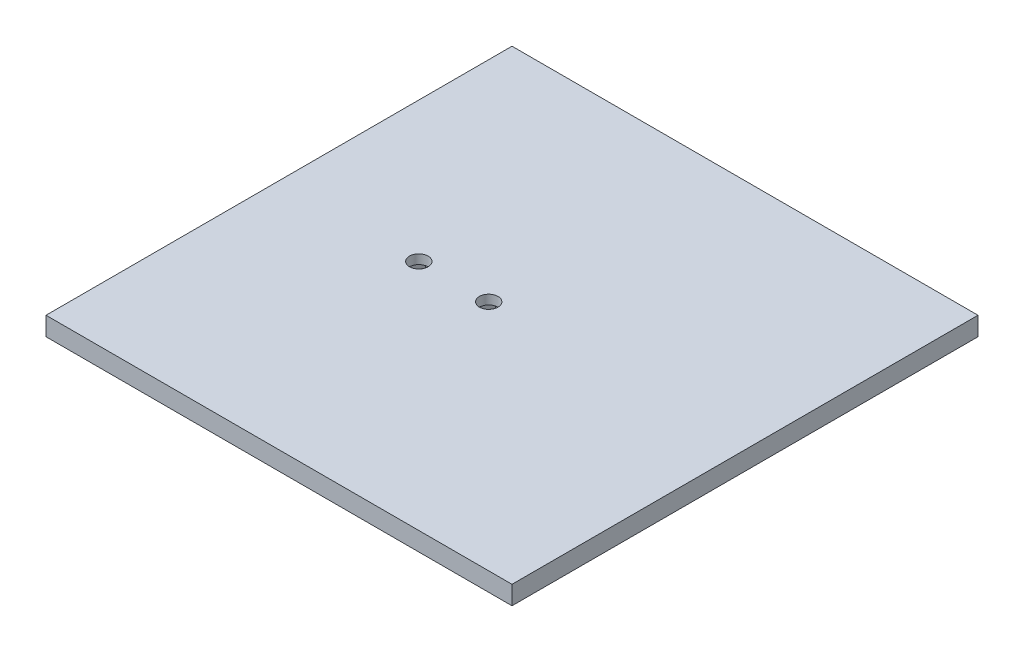
ISO-10303-21;
HEADER;
FILE_DESCRIPTION(('STEP AP214'),'2;1');
FILE_NAME('part.step','',(''),(''),'','','');
FILE_SCHEMA(('AUTOMOTIVE_DESIGN { 1 0 10303 214 1 1 1 1 }'));
ENDSEC;
DATA;
#1=APPLICATION_CONTEXT('core data for automotive mechanical design processes');
#2=APPLICATION_PROTOCOL_DEFINITION('international standard','automotive_design',2000,#1);
#3=PRODUCT_CONTEXT('',#1,'mechanical');
#4=PRODUCT('Part','Part','',(#3));
#5=PRODUCT_RELATED_PRODUCT_CATEGORY('part','',(#4));
#6=PRODUCT_DEFINITION_FORMATION('','',#4);
#7=PRODUCT_DEFINITION_CONTEXT('part definition',#1,'design');
#8=PRODUCT_DEFINITION('design','',#6,#7);
#9=PRODUCT_DEFINITION_SHAPE('','',#8);
#10=(LENGTH_UNIT() NAMED_UNIT(*) SI_UNIT(.MILLI.,.METRE.));
#11=(NAMED_UNIT(*) PLANE_ANGLE_UNIT() SI_UNIT($,.RADIAN.));
#12=(NAMED_UNIT(*) SI_UNIT($,.STERADIAN.) SOLID_ANGLE_UNIT());
#13=UNCERTAINTY_MEASURE_WITH_UNIT(LENGTH_MEASURE(1.E-05),#10,'distance_accuracy_value','');
#14=(GEOMETRIC_REPRESENTATION_CONTEXT(3) GLOBAL_UNCERTAINTY_ASSIGNED_CONTEXT((#13)) GLOBAL_UNIT_ASSIGNED_CONTEXT((#10,
#11,#12)) REPRESENTATION_CONTEXT('',''));
#15=CARTESIAN_POINT('',(0.,0.,0.));
#16=DIRECTION('',(0.,0.,1.));
#17=DIRECTION('',(1.,0.,0.));
#18=AXIS2_PLACEMENT_3D('',#15,#16,#17);
#19=CARTESIAN_POINT('',(-34.8765432098765,4.,-23.5339506172839));
#20=DIRECTION('',(1.,0.,0.));
#21=DIRECTION('',(0.,0.,-1.));
#22=AXIS2_PLACEMENT_3D('',#19,#20,#21);
#23=PLANE('',#22);
#24=DIRECTION('',(0.,0.,1.));
#25=VECTOR('',#24,1.);
#26=CARTESIAN_POINT('',(-34.8765432098765,0.,-23.5339506172839));
#27=LINE('',#26,#25);
#28=CARTESIAN_POINT('',(-34.8765432098765,0.,-23.5339506172839));
#29=VERTEX_POINT('',#28);
#30=CARTESIAN_POINT('',(-34.8765432098765,0.,76.4660493827161));
#31=VERTEX_POINT('',#30);
#32=EDGE_CURVE('E302',#29,#31,#27,.T.);
#33=ORIENTED_EDGE('',*,*,#32,.T.);
#34=DIRECTION('',(0.,-1.,0.));
#35=VECTOR('',#34,1.);
#36=CARTESIAN_POINT('',(-34.8765432098765,4.,76.4660493827161));
#37=LINE('',#36,#35);
#38=CARTESIAN_POINT('',(-34.8765432098765,4.,76.4660493827161));
#39=VERTEX_POINT('',#38);
#40=EDGE_CURVE('E11',#39,#31,#37,.T.);
#41=ORIENTED_EDGE('',*,*,#40,.F.);
#42=DIRECTION('',(0.,0.,1.));
#43=VECTOR('',#42,1.);
#44=CARTESIAN_POINT('',(-34.8765432098765,4.,-23.5339506172839));
#45=LINE('',#44,#43);
#46=CARTESIAN_POINT('',(-34.8765432098765,4.,-23.5339506172839));
#47=VERTEX_POINT('',#46);
#48=EDGE_CURVE('E310',#47,#39,#45,.T.);
#49=ORIENTED_EDGE('',*,*,#48,.F.);
#50=DIRECTION('',(0.,-1.,0.));
#51=VECTOR('',#50,1.);
#52=CARTESIAN_POINT('',(-34.8765432098765,4.,-23.5339506172839));
#53=LINE('',#52,#51);
#54=EDGE_CURVE('E324',#47,#29,#53,.T.);
#55=ORIENTED_EDGE('',*,*,#54,.T.);
#56=EDGE_LOOP('',(#33,#41,#49,#55));
#57=FACE_BOUND('',#56,.T.);
#58=ADVANCED_FACE('F43',(#57),#23,.F.);
#59=CARTESIAN_POINT('',(-34.8765432098765,4.,76.4660493827161));
#60=DIRECTION('',(0.,0.,-1.));
#61=DIRECTION('',(-1.,0.,0.));
#62=AXIS2_PLACEMENT_3D('',#59,#60,#61);
#63=PLANE('',#62);
#64=DIRECTION('',(1.,0.,0.));
#65=VECTOR('',#64,1.);
#66=CARTESIAN_POINT('',(-34.8765432098765,0.,76.4660493827161));
#67=LINE('',#66,#65);
#68=CARTESIAN_POINT('',(65.1234567901235,0.,76.4660493827161));
#69=VERTEX_POINT('',#68);
#70=EDGE_CURVE('E328',#31,#69,#67,.T.);
#71=ORIENTED_EDGE('',*,*,#70,.T.);
#72=DIRECTION('',(0.,-1.,0.));
#73=VECTOR('',#72,1.);
#74=CARTESIAN_POINT('',(65.1234567901235,4.,76.4660493827161));
#75=LINE('',#74,#73);
#76=CARTESIAN_POINT('',(65.1234567901235,4.,76.4660493827161));
#77=VERTEX_POINT('',#76);
#78=EDGE_CURVE('E51',#77,#69,#75,.T.);
#79=ORIENTED_EDGE('',*,*,#78,.F.);
#80=DIRECTION('',(1.,0.,0.));
#81=VECTOR('',#80,1.);
#82=CARTESIAN_POINT('',(-34.8765432098765,4.,76.4660493827161));
#83=LINE('',#82,#81);
#84=EDGE_CURVE('E314',#39,#77,#83,.T.);
#85=ORIENTED_EDGE('',*,*,#84,.F.);
#86=ORIENTED_EDGE('',*,*,#40,.T.);
#87=EDGE_LOOP('',(#71,#79,#85,#86));
#88=FACE_BOUND('',#87,.T.);
#89=ADVANCED_FACE('F364',(#88),#63,.F.);
#90=CARTESIAN_POINT('',(65.1234567901235,4.,-23.5339506172839));
#91=DIRECTION('',(-1.,0.,0.));
#92=DIRECTION('',(0.,0.,1.));
#93=AXIS2_PLACEMENT_3D('',#90,#91,#92);
#94=PLANE('',#93);
#95=DIRECTION('',(0.,0.,-1.));
#96=VECTOR('',#95,1.);
#97=CARTESIAN_POINT('',(65.1234567901235,0.,-23.5339506172839));
#98=LINE('',#97,#96);
#99=CARTESIAN_POINT('',(65.1234567901235,0.,-23.5339506172839));
#100=VERTEX_POINT('',#99);
#101=EDGE_CURVE('E331',#69,#100,#98,.T.);
#102=ORIENTED_EDGE('',*,*,#101,.T.);
#103=DIRECTION('',(0.,-1.,0.));
#104=VECTOR('',#103,1.);
#105=CARTESIAN_POINT('',(65.1234567901235,4.,-23.5339506172839));
#106=LINE('',#105,#104);
#107=CARTESIAN_POINT('',(65.1234567901235,4.,-23.5339506172839));
#108=VERTEX_POINT('',#107);
#109=EDGE_CURVE('E339',#108,#100,#106,.T.);
#110=ORIENTED_EDGE('',*,*,#109,.F.);
#111=DIRECTION('',(0.,0.,-1.));
#112=VECTOR('',#111,1.);
#113=CARTESIAN_POINT('',(65.1234567901235,4.,-23.5339506172839));
#114=LINE('',#113,#112);
#115=EDGE_CURVE('E318',#77,#108,#114,.T.);
#116=ORIENTED_EDGE('',*,*,#115,.F.);
#117=ORIENTED_EDGE('',*,*,#78,.T.);
#118=EDGE_LOOP('',(#102,#110,#116,#117));
#119=FACE_BOUND('',#118,.T.);
#120=ADVANCED_FACE('F348',(#119),#94,.F.);
#121=CARTESIAN_POINT('',(-34.8765432098765,4.,-23.5339506172839));
#122=DIRECTION('',(0.,0.,1.));
#123=DIRECTION('',(1.,0.,0.));
#124=AXIS2_PLACEMENT_3D('',#121,#122,#123);
#125=PLANE('',#124);
#126=DIRECTION('',(-1.,0.,0.));
#127=VECTOR('',#126,1.);
#128=CARTESIAN_POINT('',(-34.8765432098765,0.,-23.5339506172839));
#129=LINE('',#128,#127);
#130=EDGE_CURVE('E315',#100,#29,#129,.T.);
#131=ORIENTED_EDGE('',*,*,#130,.T.);
#132=ORIENTED_EDGE('',*,*,#54,.F.);
#133=DIRECTION('',(-1.,0.,0.));
#134=VECTOR('',#133,1.);
#135=CARTESIAN_POINT('',(-34.8765432098765,4.,-23.5339506172839));
#136=LINE('',#135,#134);
#137=EDGE_CURVE('E321',#108,#47,#136,.T.);
#138=ORIENTED_EDGE('',*,*,#137,.F.);
#139=ORIENTED_EDGE('',*,*,#109,.T.);
#140=EDGE_LOOP('',(#131,#132,#138,#139));
#141=FACE_BOUND('',#140,.T.);
#142=ADVANCED_FACE('F357',(#141),#125,.F.);
#143=CARTESIAN_POINT('',(0.,4.,0.));
#144=DIRECTION('',(0.,1.,0.));
#145=DIRECTION('',(0.,0.,1.));
#146=AXIS2_PLACEMENT_3D('',#143,#144,#145);
#147=PLANE('',#146);
#148=CARTESIAN_POINT('',(10.1234567901235,4.,26.4660493827161));
#149=DIRECTION('',(0.,1.,0.));
#150=DIRECTION('',(0.,0.,1.));
#151=AXIS2_PLACEMENT_3D('',#148,#149,#150);
#152=CIRCLE('',#151,2.);
#153=CARTESIAN_POINT('',(10.1234567901235,4.,28.4660493827161));
#154=VERTEX_POINT('',#153);
#155=EDGE_CURVE('E298',#154,#154,#152,.T.);
#156=ORIENTED_EDGE('',*,*,#155,.F.);
#157=EDGE_LOOP('',(#156));
#158=FACE_BOUND('',#157,.T.);
#159=CARTESIAN_POINT('',(-4.87654320987654,4.,26.4660493827161));
#160=DIRECTION('',(0.,1.,0.));
#161=DIRECTION('',(0.,0.,1.));
#162=AXIS2_PLACEMENT_3D('',#159,#160,#161);
#163=CIRCLE('',#162,2.);
#164=CARTESIAN_POINT('',(-4.87654320987654,4.,28.4660493827161));
#165=VERTEX_POINT('',#164);
#166=EDGE_CURVE('E303',#165,#165,#163,.T.);
#167=ORIENTED_EDGE('',*,*,#166,.F.);
#168=EDGE_LOOP('',(#167));
#169=FACE_BOUND('',#168,.T.);
#170=ORIENTED_EDGE('',*,*,#48,.T.);
#171=ORIENTED_EDGE('',*,*,#84,.T.);
#172=ORIENTED_EDGE('',*,*,#115,.T.);
#173=ORIENTED_EDGE('',*,*,#137,.T.);
#174=EDGE_LOOP('',(#170,#171,#172,#173));
#175=FACE_BOUND('',#174,.T.);
#176=ADVANCED_FACE('F363',(#158,#169,#175),#147,.T.);
#177=CARTESIAN_POINT('',(0.,0.,0.));
#178=DIRECTION('',(0.,1.,0.));
#179=DIRECTION('',(0.,0.,1.));
#180=AXIS2_PLACEMENT_3D('',#177,#178,#179);
#181=PLANE('',#180);
#182=DIRECTION('',(-0.5,0.,0.866025403784439));
#183=VECTOR('',#182,1.);
#184=CARTESIAN_POINT('',(-0.835091325549156,0.,26.4660493827161));
#185=LINE('',#184,#183);
#186=CARTESIAN_POINT('',(-0.835091325549155,0.,26.4660493827161));
#187=VERTEX_POINT('',#186);
#188=CARTESIAN_POINT('',(-2.85581726771284,0.,29.9660493827161));
#189=VERTEX_POINT('',#188);
#190=EDGE_CURVE('E201',#187,#189,#185,.T.);
#191=ORIENTED_EDGE('',*,*,#190,.F.);
#192=DIRECTION('',(0.5,0.,0.866025403784439));
#193=VECTOR('',#192,1.);
#194=CARTESIAN_POINT('',(-2.85581726771285,0.,22.9660493827161));
#195=LINE('',#194,#193);
#196=CARTESIAN_POINT('',(-2.85581726771285,0.,22.9660493827161));
#197=VERTEX_POINT('',#196);
#198=EDGE_CURVE('E58',#197,#187,#195,.T.);
#199=ORIENTED_EDGE('',*,*,#198,.F.);
#200=DIRECTION('',(1.,0.,0.));
#201=VECTOR('',#200,1.);
#202=CARTESIAN_POINT('',(-6.89726915204023,0.,22.9660493827161));
#203=LINE('',#202,#201);
#204=CARTESIAN_POINT('',(-6.89726915204023,0.,22.9660493827161));
#205=VERTEX_POINT('',#204);
#206=EDGE_CURVE('E181',#205,#197,#203,.T.);
#207=ORIENTED_EDGE('',*,*,#206,.F.);
#208=DIRECTION('',(0.5,0.,-0.866025403784439));
#209=VECTOR('',#208,1.);
#210=CARTESIAN_POINT('',(-8.91799509420392,0.,26.4660493827161));
#211=LINE('',#210,#209);
#212=CARTESIAN_POINT('',(-8.91799509420392,0.,26.4660493827161));
#213=VERTEX_POINT('',#212);
#214=EDGE_CURVE('E185',#213,#205,#211,.T.);
#215=ORIENTED_EDGE('',*,*,#214,.F.);
#216=DIRECTION('',(-0.5,0.,-0.866025403784439));
#217=VECTOR('',#216,1.);
#218=CARTESIAN_POINT('',(-6.89726915204023,0.,29.9660493827161));
#219=LINE('',#218,#217);
#220=CARTESIAN_POINT('',(-6.89726915204023,0.,29.9660493827161));
#221=VERTEX_POINT('',#220);
#222=EDGE_CURVE('E208',#221,#213,#219,.T.);
#223=ORIENTED_EDGE('',*,*,#222,.F.);
#224=DIRECTION('',(-1.,0.,0.));
#225=VECTOR('',#224,1.);
#226=CARTESIAN_POINT('',(-2.85581726771284,0.,29.9660493827161));
#227=LINE('',#226,#225);
#228=EDGE_CURVE('E204',#189,#221,#227,.T.);
#229=ORIENTED_EDGE('',*,*,#228,.F.);
#230=EDGE_LOOP('',(#191,#199,#207,#215,#223,#229));
#231=FACE_BOUND('',#230,.T.);
#232=DIRECTION('',(-0.5,0.,0.866025403784439));
#233=VECTOR('',#232,1.);
#234=CARTESIAN_POINT('',(14.1649086744508,0.,26.4660493827161));
#235=LINE('',#234,#233);
#236=CARTESIAN_POINT('',(14.1649086744508,0.,26.4660493827161));
#237=VERTEX_POINT('',#236);
#238=CARTESIAN_POINT('',(12.1441827322872,0.,29.9660493827161));
#239=VERTEX_POINT('',#238);
#240=EDGE_CURVE('E266',#237,#239,#235,.T.);
#241=ORIENTED_EDGE('',*,*,#240,.F.);
#242=DIRECTION('',(0.5,0.,0.866025403784439));
#243=VECTOR('',#242,1.);
#244=CARTESIAN_POINT('',(12.1441827322871,0.,22.9660493827161));
#245=LINE('',#244,#243);
#246=CARTESIAN_POINT('',(12.1441827322871,0.,22.9660493827161));
#247=VERTEX_POINT('',#246);
#248=EDGE_CURVE('E66',#247,#237,#245,.T.);
#249=ORIENTED_EDGE('',*,*,#248,.F.);
#250=DIRECTION('',(1.,0.,0.));
#251=VECTOR('',#250,1.);
#252=CARTESIAN_POINT('',(8.10273084795977,0.,22.9660493827161));
#253=LINE('',#252,#251);
#254=CARTESIAN_POINT('',(8.10273084795977,0.,22.9660493827161));
#255=VERTEX_POINT('',#254);
#256=EDGE_CURVE('E249',#255,#247,#253,.T.);
#257=ORIENTED_EDGE('',*,*,#256,.F.);
#258=DIRECTION('',(0.5,0.,-0.866025403784439));
#259=VECTOR('',#258,1.);
#260=CARTESIAN_POINT('',(6.08200490579608,0.,26.4660493827161));
#261=LINE('',#260,#259);
#262=CARTESIAN_POINT('',(6.08200490579608,0.,26.4660493827161));
#263=VERTEX_POINT('',#262);
#264=EDGE_CURVE('E253',#263,#255,#261,.T.);
#265=ORIENTED_EDGE('',*,*,#264,.F.);
#266=DIRECTION('',(-0.5,0.,-0.866025403784438));
#267=VECTOR('',#266,1.);
#268=CARTESIAN_POINT('',(8.10273084795977,0.,29.9660493827161));
#269=LINE('',#268,#267);
#270=CARTESIAN_POINT('',(8.10273084795977,0.,29.9660493827161));
#271=VERTEX_POINT('',#270);
#272=EDGE_CURVE('E258',#271,#263,#269,.T.);
#273=ORIENTED_EDGE('',*,*,#272,.F.);
#274=DIRECTION('',(-1.,0.,0.));
#275=VECTOR('',#274,1.);
#276=CARTESIAN_POINT('',(12.1441827322872,0.,29.9660493827161));
#277=LINE('',#276,#275);
#278=EDGE_CURVE('E262',#239,#271,#277,.T.);
#279=ORIENTED_EDGE('',*,*,#278,.F.);
#280=EDGE_LOOP('',(#241,#249,#257,#265,#273,#279));
#281=FACE_BOUND('',#280,.T.);
#282=ORIENTED_EDGE('',*,*,#32,.F.);
#283=ORIENTED_EDGE('',*,*,#130,.F.);
#284=ORIENTED_EDGE('',*,*,#101,.F.);
#285=ORIENTED_EDGE('',*,*,#70,.F.);
#286=EDGE_LOOP('',(#282,#283,#284,#285));
#287=FACE_BOUND('',#286,.T.);
#288=ADVANCED_FACE('F354',(#231,#281,#287),#181,.F.);
#289=CARTESIAN_POINT('',(-4.87654320987654,2.,26.4660493827161));
#290=DIRECTION('',(0.,1.,0.));
#291=DIRECTION('',(0.,0.,1.));
#292=AXIS2_PLACEMENT_3D('',#289,#290,#291);
#293=CYLINDRICAL_SURFACE('',#292,2.);
#294=CARTESIAN_POINT('',(-4.87654320987654,2.,26.4660493827161));
#295=DIRECTION('',(0.,1.,0.));
#296=DIRECTION('',(0.,0.,1.));
#297=AXIS2_PLACEMENT_3D('',#294,#295,#296);
#298=CIRCLE('',#297,2.);
#299=CARTESIAN_POINT('',(-4.87654320987654,2.,28.4660493827161));
#300=VERTEX_POINT('',#299);
#301=EDGE_CURVE('E297',#300,#300,#298,.T.);
#302=ORIENTED_EDGE('',*,*,#301,.F.);
#303=EDGE_LOOP('',(#302));
#304=FACE_BOUND('',#303,.T.);
#305=ORIENTED_EDGE('',*,*,#166,.T.);
#306=EDGE_LOOP('',(#305));
#307=FACE_BOUND('',#306,.T.);
#308=ADVANCED_FACE('F376',(#304,#307),#293,.F.);
#309=CARTESIAN_POINT('',(10.1234567901235,2.,26.4660493827161));
#310=DIRECTION('',(0.,1.,0.));
#311=DIRECTION('',(0.,0.,1.));
#312=AXIS2_PLACEMENT_3D('',#309,#310,#311);
#313=CYLINDRICAL_SURFACE('',#312,2.);
#314=CARTESIAN_POINT('',(10.1234567901235,2.,26.4660493827161));
#315=DIRECTION('',(0.,1.,0.));
#316=DIRECTION('',(0.,0.,1.));
#317=AXIS2_PLACEMENT_3D('',#314,#315,#316);
#318=CIRCLE('',#317,2.);
#319=CARTESIAN_POINT('',(10.1234567901235,2.,28.4660493827161));
#320=VERTEX_POINT('',#319);
#321=EDGE_CURVE('E218',#320,#320,#318,.T.);
#322=ORIENTED_EDGE('',*,*,#321,.F.);
#323=EDGE_LOOP('',(#322));
#324=FACE_BOUND('',#323,.T.);
#325=ORIENTED_EDGE('',*,*,#155,.T.);
#326=EDGE_LOOP('',(#325));
#327=FACE_BOUND('',#326,.T.);
#328=ADVANCED_FACE('F383',(#324,#327),#313,.F.);
#329=CARTESIAN_POINT('',(0.,2.,0.));
#330=DIRECTION('',(0.,-1.,0.));
#331=DIRECTION('',(0.,0.,-1.));
#332=AXIS2_PLACEMENT_3D('',#329,#330,#331);
#333=PLANE('',#332);
#334=DIRECTION('',(0.5,0.,0.866025403784439));
#335=VECTOR('',#334,1.);
#336=CARTESIAN_POINT('',(12.1441827322871,2.,22.9660493827161));
#337=LINE('',#336,#335);
#338=CARTESIAN_POINT('',(12.1441827322871,2.,22.9660493827161));
#339=VERTEX_POINT('',#338);
#340=CARTESIAN_POINT('',(14.1649086744508,2.,26.4660493827161));
#341=VERTEX_POINT('',#340);
#342=EDGE_CURVE('E254',#339,#341,#337,.T.);
#343=ORIENTED_EDGE('',*,*,#342,.T.);
#344=DIRECTION('',(-0.5,0.,0.866025403784439));
#345=VECTOR('',#344,1.);
#346=CARTESIAN_POINT('',(14.1649086744508,2.,26.4660493827161));
#347=LINE('',#346,#345);
#348=CARTESIAN_POINT('',(12.1441827322872,2.,29.9660493827161));
#349=VERTEX_POINT('',#348);
#350=EDGE_CURVE('E287',#341,#349,#347,.T.);
#351=ORIENTED_EDGE('',*,*,#350,.T.);
#352=DIRECTION('',(-1.,0.,0.));
#353=VECTOR('',#352,1.);
#354=CARTESIAN_POINT('',(12.1441827322872,2.,29.9660493827161));
#355=LINE('',#354,#353);
#356=CARTESIAN_POINT('',(8.10273084795977,2.,29.9660493827161));
#357=VERTEX_POINT('',#356);
#358=EDGE_CURVE('E283',#349,#357,#355,.T.);
#359=ORIENTED_EDGE('',*,*,#358,.T.);
#360=DIRECTION('',(-0.5,0.,-0.866025403784438));
#361=VECTOR('',#360,1.);
#362=CARTESIAN_POINT('',(8.10273084795977,2.,29.9660493827161));
#363=LINE('',#362,#361);
#364=CARTESIAN_POINT('',(6.08200490579608,2.,26.4660493827161));
#365=VERTEX_POINT('',#364);
#366=EDGE_CURVE('E279',#357,#365,#363,.T.);
#367=ORIENTED_EDGE('',*,*,#366,.T.);
#368=DIRECTION('',(0.5,0.,-0.866025403784439));
#369=VECTOR('',#368,1.);
#370=CARTESIAN_POINT('',(6.08200490579608,2.,26.4660493827161));
#371=LINE('',#370,#369);
#372=CARTESIAN_POINT('',(8.10273084795977,2.,22.9660493827161));
#373=VERTEX_POINT('',#372);
#374=EDGE_CURVE('E275',#365,#373,#371,.T.);
#375=ORIENTED_EDGE('',*,*,#374,.T.);
#376=DIRECTION('',(1.,0.,0.));
#377=VECTOR('',#376,1.);
#378=CARTESIAN_POINT('',(8.10273084795977,2.,22.9660493827161));
#379=LINE('',#378,#377);
#380=EDGE_CURVE('E233',#373,#339,#379,.T.);
#381=ORIENTED_EDGE('',*,*,#380,.T.);
#382=EDGE_LOOP('',(#343,#351,#359,#367,#375,#381));
#383=FACE_BOUND('',#382,.T.);
#384=ORIENTED_EDGE('',*,*,#321,.T.);
#385=EDGE_LOOP('',(#384));
#386=FACE_BOUND('',#385,.T.);
#387=ADVANCED_FACE('F387',(#383,#386),#333,.T.);
#388=CARTESIAN_POINT('',(12.1441827322871,2.,22.9660493827161));
#389=DIRECTION('',(0.866025403784439,0.,-0.5));
#390=DIRECTION('',(-0.5,0.,-0.866025403784439));
#391=AXIS2_PLACEMENT_3D('',#388,#389,#390);
#392=PLANE('',#391);
#393=ORIENTED_EDGE('',*,*,#248,.T.);
#394=DIRECTION('',(0.,-1.,0.));
#395=VECTOR('',#394,1.);
#396=CARTESIAN_POINT('',(14.1649086744508,2.,26.4660493827161));
#397=LINE('',#396,#395);
#398=EDGE_CURVE('E230',#341,#237,#397,.T.);
#399=ORIENTED_EDGE('',*,*,#398,.F.);
#400=ORIENTED_EDGE('',*,*,#342,.F.);
#401=DIRECTION('',(0.,-1.,0.));
#402=VECTOR('',#401,1.);
#403=CARTESIAN_POINT('',(12.1441827322871,2.,22.9660493827161));
#404=LINE('',#403,#402);
#405=EDGE_CURVE('E246',#339,#247,#404,.T.);
#406=ORIENTED_EDGE('',*,*,#405,.T.);
#407=EDGE_LOOP('',(#393,#399,#400,#406));
#408=FACE_BOUND('',#407,.T.);
#409=ADVANCED_FACE('F391',(#408),#392,.F.);
#410=CARTESIAN_POINT('',(8.10273084795977,2.,22.9660493827161));
#411=DIRECTION('',(0.,0.,-1.));
#412=DIRECTION('',(-1.,0.,0.));
#413=AXIS2_PLACEMENT_3D('',#410,#411,#412);
#414=PLANE('',#413);
#415=ORIENTED_EDGE('',*,*,#256,.T.);
#416=ORIENTED_EDGE('',*,*,#405,.F.);
#417=ORIENTED_EDGE('',*,*,#380,.F.);
#418=DIRECTION('',(0.,-1.,0.));
#419=VECTOR('',#418,1.);
#420=CARTESIAN_POINT('',(8.10273084795977,2.,22.9660493827161));
#421=LINE('',#420,#419);
#422=EDGE_CURVE('E243',#373,#255,#421,.T.);
#423=ORIENTED_EDGE('',*,*,#422,.T.);
#424=EDGE_LOOP('',(#415,#416,#417,#423));
#425=FACE_BOUND('',#424,.T.);
#426=ADVANCED_FACE('F393',(#425),#414,.F.);
#427=CARTESIAN_POINT('',(6.08200490579608,2.,26.4660493827161));
#428=DIRECTION('',(-0.866025403784439,0.,-0.5));
#429=DIRECTION('',(-0.5,0.,0.866025403784439));
#430=AXIS2_PLACEMENT_3D('',#427,#428,#429);
#431=PLANE('',#430);
#432=ORIENTED_EDGE('',*,*,#264,.T.);
#433=ORIENTED_EDGE('',*,*,#422,.F.);
#434=ORIENTED_EDGE('',*,*,#374,.F.);
#435=DIRECTION('',(0.,-1.,0.));
#436=VECTOR('',#435,1.);
#437=CARTESIAN_POINT('',(6.08200490579608,2.,26.4660493827161));
#438=LINE('',#437,#436);
#439=EDGE_CURVE('E240',#365,#263,#438,.T.);
#440=ORIENTED_EDGE('',*,*,#439,.T.);
#441=EDGE_LOOP('',(#432,#433,#434,#440));
#442=FACE_BOUND('',#441,.T.);
#443=ADVANCED_FACE('F396',(#442),#431,.F.);
#444=CARTESIAN_POINT('',(8.10273084795977,2.,29.9660493827161));
#445=DIRECTION('',(-0.866025403784438,0.,0.5));
#446=DIRECTION('',(0.5,0.,0.866025403784439));
#447=AXIS2_PLACEMENT_3D('',#444,#445,#446);
#448=PLANE('',#447);
#449=ORIENTED_EDGE('',*,*,#272,.T.);
#450=ORIENTED_EDGE('',*,*,#439,.F.);
#451=ORIENTED_EDGE('',*,*,#366,.F.);
#452=DIRECTION('',(0.,-1.,0.));
#453=VECTOR('',#452,1.);
#454=CARTESIAN_POINT('',(8.10273084795977,2.,29.9660493827161));
#455=LINE('',#454,#453);
#456=EDGE_CURVE('E237',#357,#271,#455,.T.);
#457=ORIENTED_EDGE('',*,*,#456,.T.);
#458=EDGE_LOOP('',(#449,#450,#451,#457));
#459=FACE_BOUND('',#458,.T.);
#460=ADVANCED_FACE('F400',(#459),#448,.F.);
#461=CARTESIAN_POINT('',(12.1441827322872,2.,29.9660493827161));
#462=DIRECTION('',(0.,0.,1.));
#463=DIRECTION('',(1.,0.,0.));
#464=AXIS2_PLACEMENT_3D('',#461,#462,#463);
#465=PLANE('',#464);
#466=ORIENTED_EDGE('',*,*,#278,.T.);
#467=ORIENTED_EDGE('',*,*,#456,.F.);
#468=ORIENTED_EDGE('',*,*,#358,.F.);
#469=DIRECTION('',(0.,-1.,0.));
#470=VECTOR('',#469,1.);
#471=CARTESIAN_POINT('',(12.1441827322872,2.,29.9660493827161));
#472=LINE('',#471,#470);
#473=EDGE_CURVE('E234',#349,#239,#472,.T.);
#474=ORIENTED_EDGE('',*,*,#473,.T.);
#475=EDGE_LOOP('',(#466,#467,#468,#474));
#476=FACE_BOUND('',#475,.T.);
#477=ADVANCED_FACE('F404',(#476),#465,.F.);
#478=CARTESIAN_POINT('',(14.1649086744508,2.,26.4660493827161));
#479=DIRECTION('',(0.866025403784438,0.,0.5));
#480=DIRECTION('',(0.5,0.,-0.866025403784439));
#481=AXIS2_PLACEMENT_3D('',#478,#479,#480);
#482=PLANE('',#481);
#483=ORIENTED_EDGE('',*,*,#240,.T.);
#484=ORIENTED_EDGE('',*,*,#473,.F.);
#485=ORIENTED_EDGE('',*,*,#350,.F.);
#486=ORIENTED_EDGE('',*,*,#398,.T.);
#487=EDGE_LOOP('',(#483,#484,#485,#486));
#488=FACE_BOUND('',#487,.T.);
#489=ADVANCED_FACE('F408',(#488),#482,.F.);
#490=CARTESIAN_POINT('',(0.,2.,0.));
#491=DIRECTION('',(0.,-1.,0.));
#492=DIRECTION('',(0.,0.,-1.));
#493=AXIS2_PLACEMENT_3D('',#490,#491,#492);
#494=PLANE('',#493);
#495=DIRECTION('',(0.5,0.,0.866025403784439));
#496=VECTOR('',#495,1.);
#497=CARTESIAN_POINT('',(-2.85581726771285,2.,22.9660493827161));
#498=LINE('',#497,#496);
#499=CARTESIAN_POINT('',(-2.85581726771285,2.,22.9660493827161));
#500=VERTEX_POINT('',#499);
#501=CARTESIAN_POINT('',(-0.835091325549156,2.,26.4660493827161));
#502=VERTEX_POINT('',#501);
#503=EDGE_CURVE('E158',#500,#502,#498,.T.);
#504=ORIENTED_EDGE('',*,*,#503,.T.);
#505=DIRECTION('',(-0.5,0.,0.866025403784439));
#506=VECTOR('',#505,1.);
#507=CARTESIAN_POINT('',(-0.835091325549156,2.,26.4660493827161));
#508=LINE('',#507,#506);
#509=CARTESIAN_POINT('',(-2.85581726771284,2.,29.9660493827161));
#510=VERTEX_POINT('',#509);
#511=EDGE_CURVE('E168',#502,#510,#508,.T.);
#512=ORIENTED_EDGE('',*,*,#511,.T.);
#513=DIRECTION('',(-1.,0.,0.));
#514=VECTOR('',#513,1.);
#515=CARTESIAN_POINT('',(-2.85581726771284,2.,29.9660493827161));
#516=LINE('',#515,#514);
#517=CARTESIAN_POINT('',(-6.89726915204023,2.,29.9660493827161));
#518=VERTEX_POINT('',#517);
#519=EDGE_CURVE('E174',#510,#518,#516,.T.);
#520=ORIENTED_EDGE('',*,*,#519,.T.);
#521=DIRECTION('',(-0.5,0.,-0.866025403784439));
#522=VECTOR('',#521,1.);
#523=CARTESIAN_POINT('',(-6.89726915204023,2.,29.9660493827161));
#524=LINE('',#523,#522);
#525=CARTESIAN_POINT('',(-8.91799509420392,2.,26.4660493827161));
#526=VERTEX_POINT('',#525);
#527=EDGE_CURVE('E190',#518,#526,#524,.T.);
#528=ORIENTED_EDGE('',*,*,#527,.T.);
#529=DIRECTION('',(0.5,0.,-0.866025403784439));
#530=VECTOR('',#529,1.);
#531=CARTESIAN_POINT('',(-8.91799509420392,2.,26.4660493827161));
#532=LINE('',#531,#530);
#533=CARTESIAN_POINT('',(-6.89726915204023,2.,22.9660493827161));
#534=VERTEX_POINT('',#533);
#535=EDGE_CURVE('E194',#526,#534,#532,.T.);
#536=ORIENTED_EDGE('',*,*,#535,.T.);
#537=DIRECTION('',(1.,0.,0.));
#538=VECTOR('',#537,1.);
#539=CARTESIAN_POINT('',(-6.89726915204023,2.,22.9660493827161));
#540=LINE('',#539,#538);
#541=EDGE_CURVE('E165',#534,#500,#540,.T.);
#542=ORIENTED_EDGE('',*,*,#541,.T.);
#543=EDGE_LOOP('',(#504,#512,#520,#528,#536,#542));
#544=FACE_BOUND('',#543,.T.);
#545=ORIENTED_EDGE('',*,*,#301,.T.);
#546=EDGE_LOOP('',(#545));
#547=FACE_BOUND('',#546,.T.);
#548=ADVANCED_FACE('F176',(#544,#547),#494,.T.);
#549=CARTESIAN_POINT('',(-2.85581726771285,2.,22.9660493827161));
#550=DIRECTION('',(0.866025403784439,0.,-0.5));
#551=DIRECTION('',(-0.5,0.,-0.866025403784439));
#552=AXIS2_PLACEMENT_3D('',#549,#550,#551);
#553=PLANE('',#552);
#554=ORIENTED_EDGE('',*,*,#198,.T.);
#555=DIRECTION('',(0.,-1.,0.));
#556=VECTOR('',#555,1.);
#557=CARTESIAN_POINT('',(-0.835091325549156,2.,26.4660493827161));
#558=LINE('',#557,#556);
#559=EDGE_CURVE('E154',#502,#187,#558,.T.);
#560=ORIENTED_EDGE('',*,*,#559,.F.);
#561=ORIENTED_EDGE('',*,*,#503,.F.);
#562=DIRECTION('',(0.,-1.,0.));
#563=VECTOR('',#562,1.);
#564=CARTESIAN_POINT('',(-2.85581726771285,2.,22.9660493827161));
#565=LINE('',#564,#563);
#566=EDGE_CURVE('E215',#500,#197,#565,.T.);
#567=ORIENTED_EDGE('',*,*,#566,.T.);
#568=EDGE_LOOP('',(#554,#560,#561,#567));
#569=FACE_BOUND('',#568,.T.);
#570=ADVANCED_FACE('F156',(#569),#553,.F.);
#571=CARTESIAN_POINT('',(-6.89726915204023,2.,22.9660493827161));
#572=DIRECTION('',(0.,0.,-1.));
#573=DIRECTION('',(-1.,0.,0.));
#574=AXIS2_PLACEMENT_3D('',#571,#572,#573);
#575=PLANE('',#574);
#576=ORIENTED_EDGE('',*,*,#206,.T.);
#577=ORIENTED_EDGE('',*,*,#566,.F.);
#578=ORIENTED_EDGE('',*,*,#541,.F.);
#579=DIRECTION('',(0.,-1.,0.));
#580=VECTOR('',#579,1.);
#581=CARTESIAN_POINT('',(-6.89726915204023,2.,22.9660493827161));
#582=LINE('',#581,#580);
#583=EDGE_CURVE('E219',#534,#205,#582,.T.);
#584=ORIENTED_EDGE('',*,*,#583,.T.);
#585=EDGE_LOOP('',(#576,#577,#578,#584));
#586=FACE_BOUND('',#585,.T.);
#587=ADVANCED_FACE('F417',(#586),#575,.F.);
#588=CARTESIAN_POINT('',(-8.91799509420392,2.,26.4660493827161));
#589=DIRECTION('',(-0.866025403784439,0.,-0.5));
#590=DIRECTION('',(-0.5,0.,0.866025403784439));
#591=AXIS2_PLACEMENT_3D('',#588,#589,#590);
#592=PLANE('',#591);
#593=ORIENTED_EDGE('',*,*,#214,.T.);
#594=ORIENTED_EDGE('',*,*,#583,.F.);
#595=ORIENTED_EDGE('',*,*,#535,.F.);
#596=DIRECTION('',(0.,-1.,0.));
#597=VECTOR('',#596,1.);
#598=CARTESIAN_POINT('',(-8.91799509420392,2.,26.4660493827161));
#599=LINE('',#598,#597);
#600=EDGE_CURVE('E222',#526,#213,#599,.T.);
#601=ORIENTED_EDGE('',*,*,#600,.T.);
#602=EDGE_LOOP('',(#593,#594,#595,#601));
#603=FACE_BOUND('',#602,.T.);
#604=ADVANCED_FACE('F427',(#603),#592,.F.);
#605=CARTESIAN_POINT('',(-6.89726915204023,2.,29.9660493827161));
#606=DIRECTION('',(-0.866025403784439,0.,0.5));
#607=DIRECTION('',(0.5,0.,0.866025403784439));
#608=AXIS2_PLACEMENT_3D('',#605,#606,#607);
#609=PLANE('',#608);
#610=ORIENTED_EDGE('',*,*,#222,.T.);
#611=ORIENTED_EDGE('',*,*,#600,.F.);
#612=ORIENTED_EDGE('',*,*,#527,.F.);
#613=DIRECTION('',(0.,-1.,0.));
#614=VECTOR('',#613,1.);
#615=CARTESIAN_POINT('',(-6.89726915204023,2.,29.9660493827161));
#616=LINE('',#615,#614);
#617=EDGE_CURVE('E225',#518,#221,#616,.T.);
#618=ORIENTED_EDGE('',*,*,#617,.T.);
#619=EDGE_LOOP('',(#610,#611,#612,#618));
#620=FACE_BOUND('',#619,.T.);
#621=ADVANCED_FACE('F423',(#620),#609,.F.);
#622=CARTESIAN_POINT('',(-2.85581726771284,2.,29.9660493827161));
#623=DIRECTION('',(0.,0.,1.));
#624=DIRECTION('',(1.,0.,0.));
#625=AXIS2_PLACEMENT_3D('',#622,#623,#624);
#626=PLANE('',#625);
#627=ORIENTED_EDGE('',*,*,#228,.T.);
#628=ORIENTED_EDGE('',*,*,#617,.F.);
#629=ORIENTED_EDGE('',*,*,#519,.F.);
#630=DIRECTION('',(0.,-1.,0.));
#631=VECTOR('',#630,1.);
#632=CARTESIAN_POINT('',(-2.85581726771284,2.,29.9660493827161));
#633=LINE('',#632,#631);
#634=EDGE_CURVE('E164',#510,#189,#633,.T.);
#635=ORIENTED_EDGE('',*,*,#634,.T.);
#636=EDGE_LOOP('',(#627,#628,#629,#635));
#637=FACE_BOUND('',#636,.T.);
#638=ADVANCED_FACE('F420',(#637),#626,.F.);
#639=CARTESIAN_POINT('',(-0.835091325549156,2.,26.4660493827161));
#640=DIRECTION('',(0.866025403784439,0.,0.5));
#641=DIRECTION('',(0.5,0.,-0.866025403784439));
#642=AXIS2_PLACEMENT_3D('',#639,#640,#641);
#643=PLANE('',#642);
#644=ORIENTED_EDGE('',*,*,#190,.T.);
#645=ORIENTED_EDGE('',*,*,#634,.F.);
#646=ORIENTED_EDGE('',*,*,#511,.F.);
#647=ORIENTED_EDGE('',*,*,#559,.T.);
#648=EDGE_LOOP('',(#644,#645,#646,#647));
#649=FACE_BOUND('',#648,.T.);
#650=ADVANCED_FACE('F169',(#649),#643,.F.);
#651=CLOSED_SHELL('',(#58,#89,#120,#142,#176,#288,#308,#328,#387,#409,#426,#443,#460,#477,#489,
#548,#570,#587,#604,#621,#638,#650));
#652=MANIFOLD_SOLID_BREP('B2',#651);
#653=ADVANCED_BREP_SHAPE_REPRESENTATION('',(#18,#652),#14);
#654=SHAPE_DEFINITION_REPRESENTATION(#9,#653);
ENDSEC;
END-ISO-10303-21;
